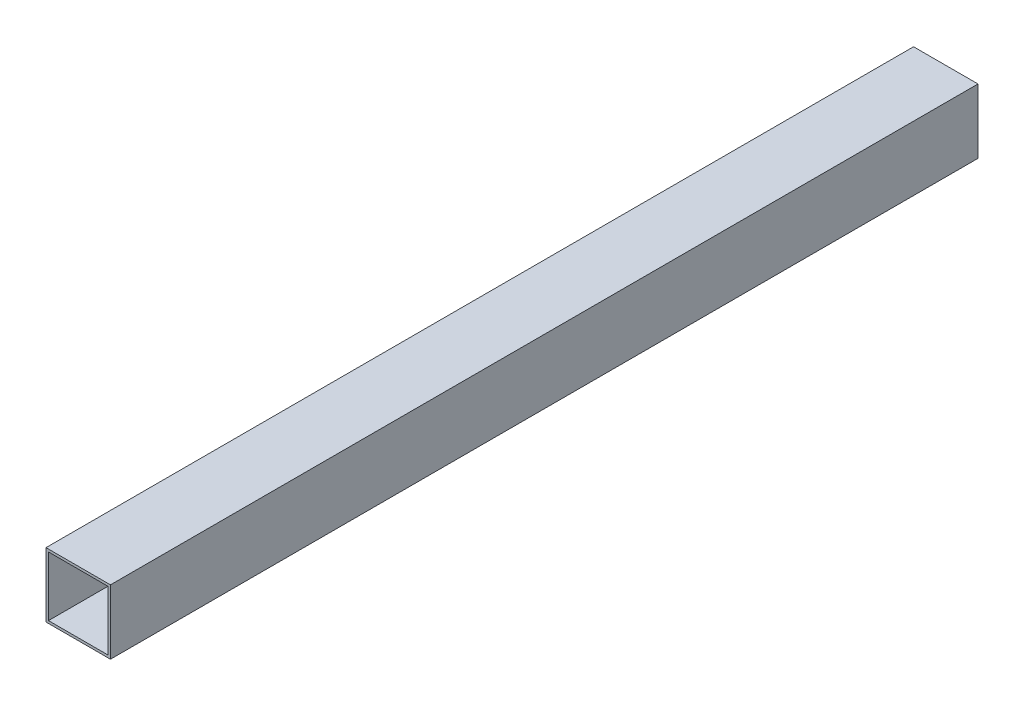
ISO-10303-21;
HEADER;
FILE_DESCRIPTION(('STEP AP214'),'2;1');
FILE_NAME('part.step','',(''),(''),'','','');
FILE_SCHEMA(('AUTOMOTIVE_DESIGN { 1 0 10303 214 1 1 1 1 }'));
ENDSEC;
DATA;
#1=APPLICATION_CONTEXT('core data for automotive mechanical design processes');
#2=APPLICATION_PROTOCOL_DEFINITION('international standard','automotive_design',2000,#1);
#3=PRODUCT_CONTEXT('',#1,'mechanical');
#4=PRODUCT('Part','Part','',(#3));
#5=PRODUCT_RELATED_PRODUCT_CATEGORY('part','',(#4));
#6=PRODUCT_DEFINITION_FORMATION('','',#4);
#7=PRODUCT_DEFINITION_CONTEXT('part definition',#1,'design');
#8=PRODUCT_DEFINITION('design','',#6,#7);
#9=PRODUCT_DEFINITION_SHAPE('','',#8);
#10=(LENGTH_UNIT() NAMED_UNIT(*) SI_UNIT(.MILLI.,.METRE.));
#11=(NAMED_UNIT(*) PLANE_ANGLE_UNIT() SI_UNIT($,.RADIAN.));
#12=(NAMED_UNIT(*) SI_UNIT($,.STERADIAN.) SOLID_ANGLE_UNIT());
#13=UNCERTAINTY_MEASURE_WITH_UNIT(LENGTH_MEASURE(1.E-05),#10,'distance_accuracy_value','');
#14=(GEOMETRIC_REPRESENTATION_CONTEXT(3) GLOBAL_UNCERTAINTY_ASSIGNED_CONTEXT((#13)) GLOBAL_UNIT_ASSIGNED_CONTEXT((#10,
#11,#12)) REPRESENTATION_CONTEXT('',''));
#15=CARTESIAN_POINT('',(0.,0.,0.));
#16=DIRECTION('',(0.,0.,1.));
#17=DIRECTION('',(1.,0.,0.));
#18=AXIS2_PLACEMENT_3D('',#15,#16,#17);
#19=CARTESIAN_POINT('',(0.,0.,1066.8));
#20=DIRECTION('',(0.,0.,1.));
#21=DIRECTION('',(1.,0.,0.));
#22=AXIS2_PLACEMENT_3D('',#19,#20,#21);
#23=PLANE('',#22);
#24=DIRECTION('',(0.,-1.,0.));
#25=VECTOR('',#24,1.);
#26=CARTESIAN_POINT('',(-39.624,-39.624,1066.8));
#27=LINE('',#26,#25);
#28=CARTESIAN_POINT('',(-39.624,39.624,1066.8));
#29=VERTEX_POINT('',#28);
#30=CARTESIAN_POINT('',(-39.624,-39.624,1066.8));
#31=VERTEX_POINT('',#30);
#32=EDGE_CURVE('E134',#29,#31,#27,.T.);
#33=ORIENTED_EDGE('',*,*,#32,.T.);
#34=DIRECTION('',(1.,0.,0.));
#35=VECTOR('',#34,1.);
#36=CARTESIAN_POINT('',(39.624,-39.624,1066.8));
#37=LINE('',#36,#35);
#38=CARTESIAN_POINT('',(39.624,-39.624,1066.8));
#39=VERTEX_POINT('',#38);
#40=EDGE_CURVE('E137',#31,#39,#37,.T.);
#41=ORIENTED_EDGE('',*,*,#40,.T.);
#42=DIRECTION('',(0.,1.,0.));
#43=VECTOR('',#42,1.);
#44=CARTESIAN_POINT('',(39.624,-39.624,1066.8));
#45=LINE('',#44,#43);
#46=CARTESIAN_POINT('',(39.624,39.624,1066.8));
#47=VERTEX_POINT('',#46);
#48=EDGE_CURVE('E140',#39,#47,#45,.T.);
#49=ORIENTED_EDGE('',*,*,#48,.T.);
#50=DIRECTION('',(-1.,0.,0.));
#51=VECTOR('',#50,1.);
#52=CARTESIAN_POINT('',(39.624,39.624,1066.8));
#53=LINE('',#52,#51);
#54=EDGE_CURVE('E142',#47,#29,#53,.T.);
#55=ORIENTED_EDGE('',*,*,#54,.T.);
#56=EDGE_LOOP('',(#33,#41,#49,#55));
#57=FACE_BOUND('',#56,.T.);
#58=DIRECTION('',(-1.,0.,0.));
#59=VECTOR('',#58,1.);
#60=CARTESIAN_POINT('',(-36.576,36.576,1066.8));
#61=LINE('',#60,#59);
#62=CARTESIAN_POINT('',(36.576,36.576,1066.8));
#63=VERTEX_POINT('',#62);
#64=CARTESIAN_POINT('',(-36.576,36.576,1066.8));
#65=VERTEX_POINT('',#64);
#66=EDGE_CURVE('E106',#63,#65,#61,.T.);
#67=ORIENTED_EDGE('',*,*,#66,.F.);
#68=DIRECTION('',(0.,1.,0.));
#69=VECTOR('',#68,1.);
#70=CARTESIAN_POINT('',(36.576,36.576,1066.8));
#71=LINE('',#70,#69);
#72=CARTESIAN_POINT('',(36.5760000000001,-36.576,1066.8));
#73=VERTEX_POINT('',#72);
#74=EDGE_CURVE('E98',#73,#63,#71,.T.);
#75=ORIENTED_EDGE('',*,*,#74,.F.);
#76=DIRECTION('',(1.,0.,0.));
#77=VECTOR('',#76,1.);
#78=CARTESIAN_POINT('',(-36.576,-36.576,1066.8));
#79=LINE('',#78,#77);
#80=CARTESIAN_POINT('',(-36.576,-36.576,1066.8));
#81=VERTEX_POINT('',#80);
#82=EDGE_CURVE('E120',#81,#73,#79,.T.);
#83=ORIENTED_EDGE('',*,*,#82,.F.);
#84=DIRECTION('',(0.,-1.,0.));
#85=VECTOR('',#84,1.);
#86=CARTESIAN_POINT('',(-36.576,36.576,1066.8));
#87=LINE('',#86,#85);
#88=EDGE_CURVE('E118',#65,#81,#87,.T.);
#89=ORIENTED_EDGE('',*,*,#88,.F.);
#90=EDGE_LOOP('',(#67,#75,#83,#89));
#91=FACE_BOUND('',#90,.T.);
#92=ADVANCED_FACE('F33',(#57,#91),#23,.T.);
#93=CARTESIAN_POINT('',(0.,0.,0.));
#94=DIRECTION('',(0.,0.,1.));
#95=DIRECTION('',(1.,0.,0.));
#96=AXIS2_PLACEMENT_3D('',#93,#94,#95);
#97=PLANE('',#96);
#98=DIRECTION('',(0.,-1.,0.));
#99=VECTOR('',#98,1.);
#100=CARTESIAN_POINT('',(-39.624,-39.624,0.));
#101=LINE('',#100,#99);
#102=CARTESIAN_POINT('',(-39.624,39.624,0.));
#103=VERTEX_POINT('',#102);
#104=CARTESIAN_POINT('',(-39.624,-39.624,0.));
#105=VERTEX_POINT('',#104);
#106=EDGE_CURVE('E114',#103,#105,#101,.T.);
#107=ORIENTED_EDGE('',*,*,#106,.F.);
#108=DIRECTION('',(-1.,0.,0.));
#109=VECTOR('',#108,1.);
#110=CARTESIAN_POINT('',(39.624,39.624,0.));
#111=LINE('',#110,#109);
#112=CARTESIAN_POINT('',(39.624,39.624,0.));
#113=VERTEX_POINT('',#112);
#114=EDGE_CURVE('E138',#113,#103,#111,.T.);
#115=ORIENTED_EDGE('',*,*,#114,.F.);
#116=DIRECTION('',(0.,1.,0.));
#117=VECTOR('',#116,1.);
#118=CARTESIAN_POINT('',(39.624,-39.624,0.));
#119=LINE('',#118,#117);
#120=CARTESIAN_POINT('',(39.624,-39.624,0.));
#121=VERTEX_POINT('',#120);
#122=EDGE_CURVE('E149',#121,#113,#119,.T.);
#123=ORIENTED_EDGE('',*,*,#122,.F.);
#124=DIRECTION('',(1.,0.,0.));
#125=VECTOR('',#124,1.);
#126=CARTESIAN_POINT('',(39.624,-39.624,0.));
#127=LINE('',#126,#125);
#128=EDGE_CURVE('E147',#105,#121,#127,.T.);
#129=ORIENTED_EDGE('',*,*,#128,.F.);
#130=EDGE_LOOP('',(#107,#115,#123,#129));
#131=FACE_BOUND('',#130,.T.);
#132=DIRECTION('',(0.,1.,0.));
#133=VECTOR('',#132,1.);
#134=CARTESIAN_POINT('',(36.576,36.576,0.));
#135=LINE('',#134,#133);
#136=CARTESIAN_POINT('',(36.5760000000001,-36.576,0.));
#137=VERTEX_POINT('',#136);
#138=CARTESIAN_POINT('',(36.576,36.576,0.));
#139=VERTEX_POINT('',#138);
#140=EDGE_CURVE('E56',#137,#139,#135,.T.);
#141=ORIENTED_EDGE('',*,*,#140,.T.);
#142=DIRECTION('',(-1.,0.,0.));
#143=VECTOR('',#142,1.);
#144=CARTESIAN_POINT('',(-36.576,36.576,0.));
#145=LINE('',#144,#143);
#146=CARTESIAN_POINT('',(-36.576,36.576,0.));
#147=VERTEX_POINT('',#146);
#148=EDGE_CURVE('E113',#139,#147,#145,.T.);
#149=ORIENTED_EDGE('',*,*,#148,.T.);
#150=DIRECTION('',(0.,-1.,0.));
#151=VECTOR('',#150,1.);
#152=CARTESIAN_POINT('',(-36.576,36.576,0.));
#153=LINE('',#152,#151);
#154=CARTESIAN_POINT('',(-36.576,-36.576,0.));
#155=VERTEX_POINT('',#154);
#156=EDGE_CURVE('E126',#147,#155,#153,.T.);
#157=ORIENTED_EDGE('',*,*,#156,.T.);
#158=DIRECTION('',(1.,0.,0.));
#159=VECTOR('',#158,1.);
#160=CARTESIAN_POINT('',(-36.576,-36.576,0.));
#161=LINE('',#160,#159);
#162=EDGE_CURVE('E107',#155,#137,#161,.T.);
#163=ORIENTED_EDGE('',*,*,#162,.T.);
#164=EDGE_LOOP('',(#141,#149,#157,#163));
#165=FACE_BOUND('',#164,.T.);
#166=ADVANCED_FACE('F167',(#131,#165),#97,.F.);
#167=CARTESIAN_POINT('',(-39.624,-39.624,1066.8));
#168=DIRECTION('',(1.,0.,0.));
#169=DIRECTION('',(0.,0.,-1.));
#170=AXIS2_PLACEMENT_3D('',#167,#168,#169);
#171=PLANE('',#170);
#172=ORIENTED_EDGE('',*,*,#106,.T.);
#173=DIRECTION('',(0.,0.,-1.));
#174=VECTOR('',#173,1.);
#175=CARTESIAN_POINT('',(-39.624,-39.624,1066.8));
#176=LINE('',#175,#174);
#177=EDGE_CURVE('E11',#31,#105,#176,.T.);
#178=ORIENTED_EDGE('',*,*,#177,.F.);
#179=ORIENTED_EDGE('',*,*,#32,.F.);
#180=DIRECTION('',(0.,0.,-1.));
#181=VECTOR('',#180,1.);
#182=CARTESIAN_POINT('',(-39.624,39.624,1066.8));
#183=LINE('',#182,#181);
#184=EDGE_CURVE('E144',#29,#103,#183,.T.);
#185=ORIENTED_EDGE('',*,*,#184,.T.);
#186=EDGE_LOOP('',(#172,#178,#179,#185));
#187=FACE_BOUND('',#186,.T.);
#188=ADVANCED_FACE('F35',(#187),#171,.F.);
#189=CARTESIAN_POINT('',(39.624,-39.624,1066.8));
#190=DIRECTION('',(0.,1.,0.));
#191=DIRECTION('',(0.,0.,1.));
#192=AXIS2_PLACEMENT_3D('',#189,#190,#191);
#193=PLANE('',#192);
#194=ORIENTED_EDGE('',*,*,#128,.T.);
#195=DIRECTION('',(0.,0.,-1.));
#196=VECTOR('',#195,1.);
#197=CARTESIAN_POINT('',(39.624,-39.624,1066.8));
#198=LINE('',#197,#196);
#199=EDGE_CURVE('E41',#39,#121,#198,.T.);
#200=ORIENTED_EDGE('',*,*,#199,.F.);
#201=ORIENTED_EDGE('',*,*,#40,.F.);
#202=ORIENTED_EDGE('',*,*,#177,.T.);
#203=EDGE_LOOP('',(#194,#200,#201,#202));
#204=FACE_BOUND('',#203,.T.);
#205=ADVANCED_FACE('F177',(#204),#193,.F.);
#206=CARTESIAN_POINT('',(39.624,-39.624,1066.8));
#207=DIRECTION('',(-1.,0.,0.));
#208=DIRECTION('',(0.,0.,1.));
#209=AXIS2_PLACEMENT_3D('',#206,#207,#208);
#210=PLANE('',#209);
#211=ORIENTED_EDGE('',*,*,#122,.T.);
#212=DIRECTION('',(0.,0.,-1.));
#213=VECTOR('',#212,1.);
#214=CARTESIAN_POINT('',(39.624,39.624,1066.8));
#215=LINE('',#214,#213);
#216=EDGE_CURVE('E154',#47,#113,#215,.T.);
#217=ORIENTED_EDGE('',*,*,#216,.F.);
#218=ORIENTED_EDGE('',*,*,#48,.F.);
#219=ORIENTED_EDGE('',*,*,#199,.T.);
#220=EDGE_LOOP('',(#211,#217,#218,#219));
#221=FACE_BOUND('',#220,.T.);
#222=ADVANCED_FACE('F161',(#221),#210,.F.);
#223=CARTESIAN_POINT('',(39.624,39.624,1066.8));
#224=DIRECTION('',(0.,-1.,0.));
#225=DIRECTION('',(0.,0.,-1.));
#226=AXIS2_PLACEMENT_3D('',#223,#224,#225);
#227=PLANE('',#226);
#228=ORIENTED_EDGE('',*,*,#114,.T.);
#229=ORIENTED_EDGE('',*,*,#184,.F.);
#230=ORIENTED_EDGE('',*,*,#54,.F.);
#231=ORIENTED_EDGE('',*,*,#216,.T.);
#232=EDGE_LOOP('',(#228,#229,#230,#231));
#233=FACE_BOUND('',#232,.T.);
#234=ADVANCED_FACE('F171',(#233),#227,.F.);
#235=CARTESIAN_POINT('',(36.576,36.576,1066.8));
#236=DIRECTION('',(-1.,0.,0.));
#237=DIRECTION('',(0.,-1.,0.));
#238=AXIS2_PLACEMENT_3D('',#235,#236,#237);
#239=PLANE('',#238);
#240=ORIENTED_EDGE('',*,*,#140,.F.);
#241=DIRECTION('',(0.,0.,-1.));
#242=VECTOR('',#241,1.);
#243=CARTESIAN_POINT('',(36.5760000000001,-36.576,1066.8));
#244=LINE('',#243,#242);
#245=EDGE_CURVE('E102',#73,#137,#244,.T.);
#246=ORIENTED_EDGE('',*,*,#245,.F.);
#247=ORIENTED_EDGE('',*,*,#74,.T.);
#248=DIRECTION('',(0.,0.,-1.));
#249=VECTOR('',#248,1.);
#250=CARTESIAN_POINT('',(36.576,36.576,1066.8));
#251=LINE('',#250,#249);
#252=EDGE_CURVE('E101',#63,#139,#251,.T.);
#253=ORIENTED_EDGE('',*,*,#252,.T.);
#254=EDGE_LOOP('',(#240,#246,#247,#253));
#255=FACE_BOUND('',#254,.T.);
#256=ADVANCED_FACE('F100',(#255),#239,.T.);
#257=CARTESIAN_POINT('',(-36.576,36.576,1066.8));
#258=DIRECTION('',(0.,-1.,0.));
#259=DIRECTION('',(0.,0.,-1.));
#260=AXIS2_PLACEMENT_3D('',#257,#258,#259);
#261=PLANE('',#260);
#262=ORIENTED_EDGE('',*,*,#148,.F.);
#263=ORIENTED_EDGE('',*,*,#252,.F.);
#264=ORIENTED_EDGE('',*,*,#66,.T.);
#265=DIRECTION('',(0.,0.,-1.));
#266=VECTOR('',#265,1.);
#267=CARTESIAN_POINT('',(-36.576,36.576,1066.8));
#268=LINE('',#267,#266);
#269=EDGE_CURVE('E115',#65,#147,#268,.T.);
#270=ORIENTED_EDGE('',*,*,#269,.T.);
#271=EDGE_LOOP('',(#262,#263,#264,#270));
#272=FACE_BOUND('',#271,.T.);
#273=ADVANCED_FACE('F110',(#272),#261,.T.);
#274=CARTESIAN_POINT('',(-36.576,36.576,1066.8));
#275=DIRECTION('',(1.,0.,0.));
#276=DIRECTION('',(0.,1.,0.));
#277=AXIS2_PLACEMENT_3D('',#274,#275,#276);
#278=PLANE('',#277);
#279=ORIENTED_EDGE('',*,*,#156,.F.);
#280=ORIENTED_EDGE('',*,*,#269,.F.);
#281=ORIENTED_EDGE('',*,*,#88,.T.);
#282=DIRECTION('',(0.,0.,-1.));
#283=VECTOR('',#282,1.);
#284=CARTESIAN_POINT('',(-36.576,-36.576,1066.8));
#285=LINE('',#284,#283);
#286=EDGE_CURVE('E48',#81,#155,#285,.T.);
#287=ORIENTED_EDGE('',*,*,#286,.T.);
#288=EDGE_LOOP('',(#279,#280,#281,#287));
#289=FACE_BOUND('',#288,.T.);
#290=ADVANCED_FACE('F200',(#289),#278,.T.);
#291=CARTESIAN_POINT('',(-36.576,-36.576,1066.8));
#292=DIRECTION('',(0.,1.,0.));
#293=DIRECTION('',(-1.,0.,0.));
#294=AXIS2_PLACEMENT_3D('',#291,#292,#293);
#295=PLANE('',#294);
#296=ORIENTED_EDGE('',*,*,#162,.F.);
#297=ORIENTED_EDGE('',*,*,#286,.F.);
#298=ORIENTED_EDGE('',*,*,#82,.T.);
#299=ORIENTED_EDGE('',*,*,#245,.T.);
#300=EDGE_LOOP('',(#296,#297,#298,#299));
#301=FACE_BOUND('',#300,.T.);
#302=ADVANCED_FACE('F204',(#301),#295,.T.);
#303=CLOSED_SHELL('',(#92,#166,#188,#205,#222,#234,#256,#273,#290,#302));
#304=MANIFOLD_SOLID_BREP('B2',#303);
#305=ADVANCED_BREP_SHAPE_REPRESENTATION('',(#18,#304),#14);
#306=SHAPE_DEFINITION_REPRESENTATION(#9,#305);
ENDSEC;
END-ISO-10303-21;
